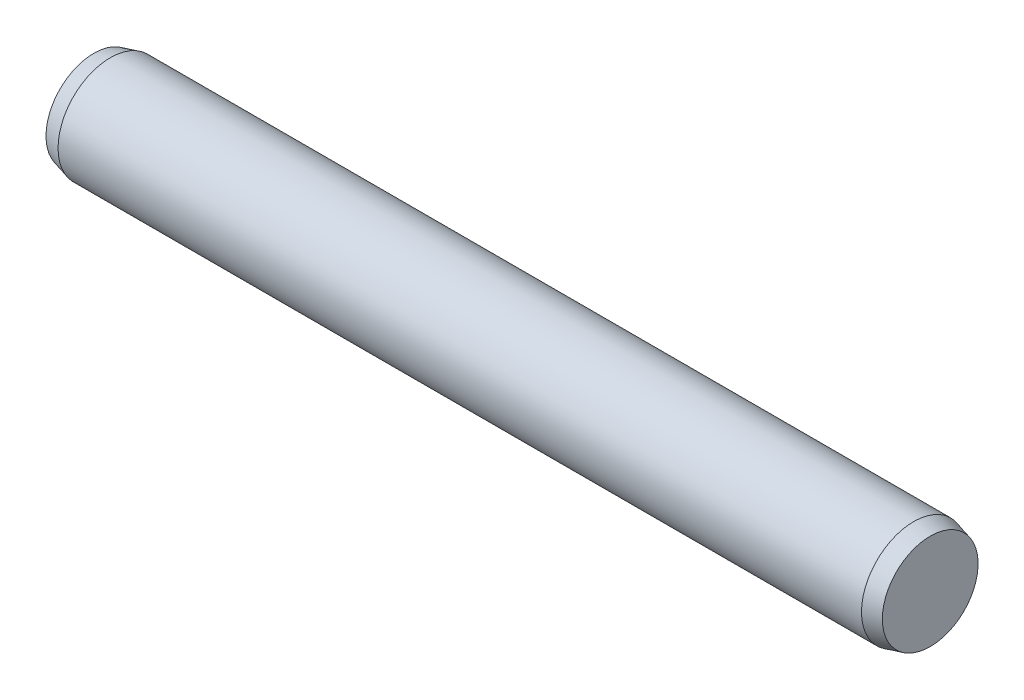
ISO-10303-21;
HEADER;
FILE_DESCRIPTION(('STEP AP214'),'2;1');
FILE_NAME('part.step','',(''),(''),'','','');
FILE_SCHEMA(('AUTOMOTIVE_DESIGN { 1 0 10303 214 1 1 1 1 }'));
ENDSEC;
DATA;
#1=APPLICATION_CONTEXT('core data for automotive mechanical design processes');
#2=APPLICATION_PROTOCOL_DEFINITION('international standard','automotive_design',2000,#1);
#3=PRODUCT_CONTEXT('',#1,'mechanical');
#4=PRODUCT('Part','Part','',(#3));
#5=PRODUCT_RELATED_PRODUCT_CATEGORY('part','',(#4));
#6=PRODUCT_DEFINITION_FORMATION('','',#4);
#7=PRODUCT_DEFINITION_CONTEXT('part definition',#1,'design');
#8=PRODUCT_DEFINITION('design','',#6,#7);
#9=PRODUCT_DEFINITION_SHAPE('','',#8);
#10=(LENGTH_UNIT() NAMED_UNIT(*) SI_UNIT(.MILLI.,.METRE.));
#11=(NAMED_UNIT(*) PLANE_ANGLE_UNIT() SI_UNIT($,.RADIAN.));
#12=(NAMED_UNIT(*) SI_UNIT($,.STERADIAN.) SOLID_ANGLE_UNIT());
#13=UNCERTAINTY_MEASURE_WITH_UNIT(LENGTH_MEASURE(1.E-05),#10,'distance_accuracy_value','');
#14=(GEOMETRIC_REPRESENTATION_CONTEXT(3) GLOBAL_UNCERTAINTY_ASSIGNED_CONTEXT((#13)) GLOBAL_UNIT_ASSIGNED_CONTEXT((#10,
#11,#12)) REPRESENTATION_CONTEXT('',''));
#15=CARTESIAN_POINT('',(0.,0.,0.));
#16=DIRECTION('',(0.,0.,1.));
#17=DIRECTION('',(1.,0.,0.));
#18=AXIS2_PLACEMENT_3D('',#15,#16,#17);
#19=CARTESIAN_POINT('',(0.,1.83119200876839,0.));
#20=DIRECTION('',(1.,0.,0.));
#21=DIRECTION('',(0.,0.,-1.));
#22=AXIS2_PLACEMENT_3D('',#19,#20,#21);
#23=PLANE('',#22);
#24=CARTESIAN_POINT('',(0.,0.,0.));
#25=DIRECTION('',(-1.,0.,0.));
#26=DIRECTION('',(0.,0.,1.));
#27=AXIS2_PLACEMENT_3D('',#24,#25,#26);
#28=CIRCLE('',#27,1.83119200876839);
#29=CARTESIAN_POINT('',(0.,0.,1.83119200876839));
#30=VERTEX_POINT('',#29);
#31=EDGE_CURVE('E45',#30,#30,#28,.T.);
#32=ORIENTED_EDGE('',*,*,#31,.T.);
#33=EDGE_LOOP('',(#32));
#34=FACE_BOUND('',#33,.T.);
#35=ADVANCED_FACE('F31',(#34),#23,.F.);
#36=CARTESIAN_POINT('',(32.,0.,0.));
#37=DIRECTION('',(-1.,0.,0.));
#38=DIRECTION('',(0.,0.,1.));
#39=AXIS2_PLACEMENT_3D('',#36,#37,#38);
#40=PLANE('',#39);
#41=CARTESIAN_POINT('',(32.,0.,0.));
#42=DIRECTION('',(-1.,0.,0.));
#43=DIRECTION('',(0.,0.,1.));
#44=AXIS2_PLACEMENT_3D('',#41,#42,#43);
#45=CIRCLE('',#44,1.8311920087684);
#46=CARTESIAN_POINT('',(32.,0.,1.8311920087684));
#47=VERTEX_POINT('',#46);
#48=EDGE_CURVE('E10',#47,#47,#45,.T.);
#49=ORIENTED_EDGE('',*,*,#48,.F.);
#50=EDGE_LOOP('',(#49));
#51=FACE_BOUND('',#50,.T.);
#52=ADVANCED_FACE('F65',(#51),#40,.F.);
#53=CARTESIAN_POINT('',(32.,0.,0.));
#54=DIRECTION('',(-1.,0.,0.));
#55=DIRECTION('',(0.,0.,1.));
#56=AXIS2_PLACEMENT_3D('',#53,#54,#55);
#57=CONICAL_SURFACE('',#56,1.8311920087684,0.26179938779915);
#58=CARTESIAN_POINT('',(31.37,0.,0.));
#59=DIRECTION('',(-1.,0.,0.));
#60=DIRECTION('',(0.,0.,1.));
#61=AXIS2_PLACEMENT_3D('',#58,#59,#60);
#62=CIRCLE('',#61,2.);
#63=CARTESIAN_POINT('',(31.37,0.,2.));
#64=VERTEX_POINT('',#63);
#65=EDGE_CURVE('E37',#64,#64,#62,.T.);
#66=ORIENTED_EDGE('',*,*,#65,.F.);
#67=EDGE_LOOP('',(#66));
#68=FACE_BOUND('',#67,.T.);
#69=ORIENTED_EDGE('',*,*,#48,.T.);
#70=EDGE_LOOP('',(#69));
#71=FACE_BOUND('',#70,.T.);
#72=ADVANCED_FACE('F60',(#68,#71),#57,.T.);
#73=CARTESIAN_POINT('',(-6.35,0.,0.));
#74=DIRECTION('',(-1.,0.,0.));
#75=DIRECTION('',(0.,0.,1.));
#76=AXIS2_PLACEMENT_3D('',#73,#74,#75);
#77=CYLINDRICAL_SURFACE('',#76,2.);
#78=CARTESIAN_POINT('',(0.63,0.,0.));
#79=DIRECTION('',(-1.,0.,0.));
#80=DIRECTION('',(0.,0.,1.));
#81=AXIS2_PLACEMENT_3D('',#78,#79,#80);
#82=CIRCLE('',#81,1.99999999999999);
#83=CARTESIAN_POINT('',(0.63,0.,1.99999999999999));
#84=VERTEX_POINT('',#83);
#85=EDGE_CURVE('E41',#84,#84,#82,.T.);
#86=ORIENTED_EDGE('',*,*,#85,.F.);
#87=EDGE_LOOP('',(#86));
#88=FACE_BOUND('',#87,.T.);
#89=ORIENTED_EDGE('',*,*,#65,.T.);
#90=EDGE_LOOP('',(#89));
#91=FACE_BOUND('',#90,.T.);
#92=ADVANCED_FACE('F55',(#88,#91),#77,.T.);
#93=CARTESIAN_POINT('',(0.63,0.,0.));
#94=DIRECTION('',(1.,0.,0.));
#95=DIRECTION('',(0.,0.,-1.));
#96=AXIS2_PLACEMENT_3D('',#93,#94,#95);
#97=CONICAL_SURFACE('',#96,1.99999999999999,0.261799387799143);
#98=ORIENTED_EDGE('',*,*,#31,.F.);
#99=EDGE_LOOP('',(#98));
#100=FACE_BOUND('',#99,.T.);
#101=ORIENTED_EDGE('',*,*,#85,.T.);
#102=EDGE_LOOP('',(#101));
#103=FACE_BOUND('',#102,.T.);
#104=ADVANCED_FACE('F52',(#100,#103),#97,.T.);
#105=CLOSED_SHELL('',(#35,#52,#72,#92,#104));
#106=MANIFOLD_SOLID_BREP('B2',#105);
#107=ADVANCED_BREP_SHAPE_REPRESENTATION('',(#18,#106),#14);
#108=SHAPE_DEFINITION_REPRESENTATION(#9,#107);
ENDSEC;
END-ISO-10303-21;
